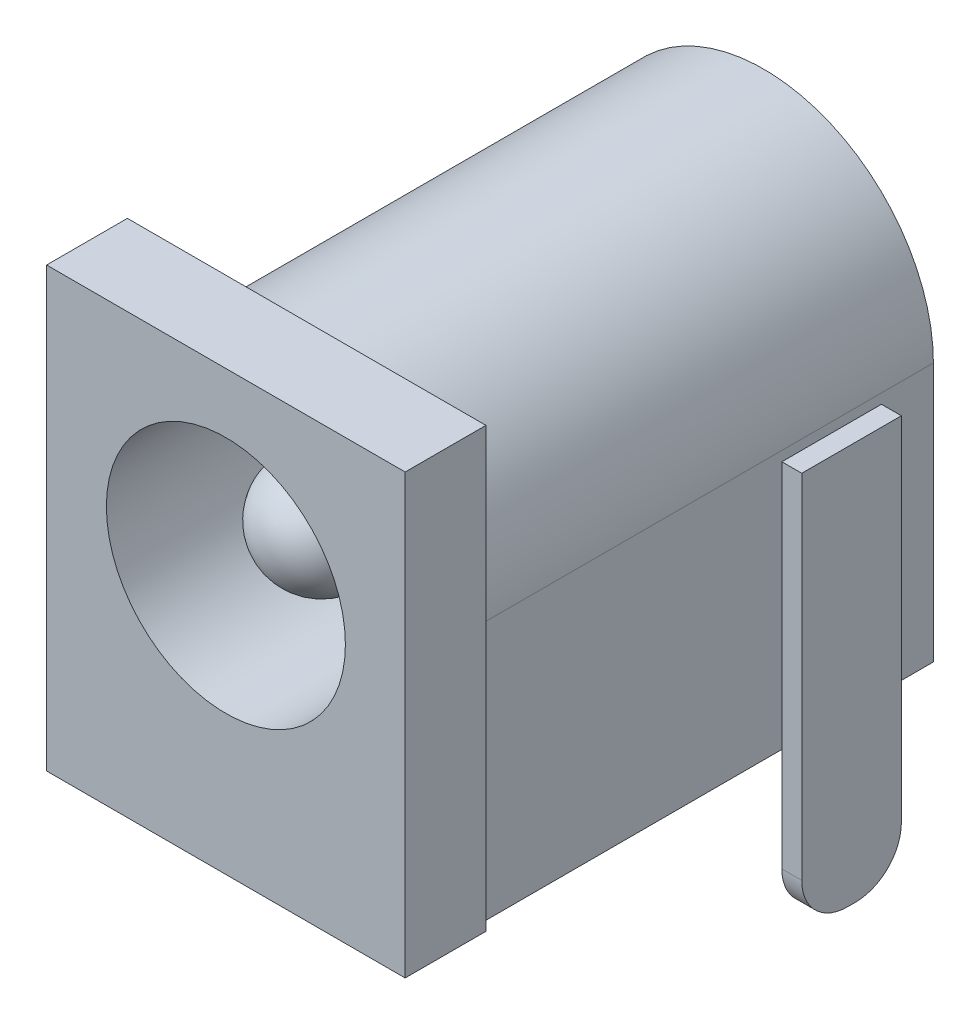
ISO-10303-21;
HEADER;
FILE_DESCRIPTION(('STEP AP214'),'2;1');
FILE_NAME('part.step','',(''),(''),'','','');
FILE_SCHEMA(('AUTOMOTIVE_DESIGN { 1 0 10303 214 1 1 1 1 }'));
ENDSEC;
DATA;
#1=APPLICATION_CONTEXT('core data for automotive mechanical design processes');
#2=APPLICATION_PROTOCOL_DEFINITION('international standard','automotive_design',2000,#1);
#3=PRODUCT_CONTEXT('',#1,'mechanical');
#4=PRODUCT('Part','Part','',(#3));
#5=PRODUCT_RELATED_PRODUCT_CATEGORY('part','',(#4));
#6=PRODUCT_DEFINITION_FORMATION('','',#4);
#7=PRODUCT_DEFINITION_CONTEXT('part definition',#1,'design');
#8=PRODUCT_DEFINITION('design','',#6,#7);
#9=PRODUCT_DEFINITION_SHAPE('','',#8);
#10=(LENGTH_UNIT() NAMED_UNIT(*) SI_UNIT(.MILLI.,.METRE.));
#11=(NAMED_UNIT(*) PLANE_ANGLE_UNIT() SI_UNIT($,.RADIAN.));
#12=(NAMED_UNIT(*) SI_UNIT($,.STERADIAN.) SOLID_ANGLE_UNIT());
#13=UNCERTAINTY_MEASURE_WITH_UNIT(LENGTH_MEASURE(1.E-05),#10,'distance_accuracy_value','');
#14=(GEOMETRIC_REPRESENTATION_CONTEXT(3) GLOBAL_UNCERTAINTY_ASSIGNED_CONTEXT((#13)) GLOBAL_UNIT_ASSIGNED_CONTEXT((#10,
#11,#12)) REPRESENTATION_CONTEXT('',''));
#15=CARTESIAN_POINT('',(0.,0.,0.));
#16=DIRECTION('',(0.,0.,1.));
#17=DIRECTION('',(1.,0.,0.));
#18=AXIS2_PLACEMENT_3D('',#15,#16,#17);
#19=CARTESIAN_POINT('',(9.50543642404111,-3.5,4.05));
#20=DIRECTION('',(-1.,0.,0.));
#21=DIRECTION('',(0.,0.,1.));
#22=AXIS2_PLACEMENT_3D('',#19,#20,#21);
#23=PLANE('',#22);
#24=CARTESIAN_POINT('',(9.50543642404111,-2.35,2.7));
#25=DIRECTION('',(1.,0.,0.));
#26=DIRECTION('',(0.,0.,-1.));
#27=AXIS2_PLACEMENT_3D('',#24,#25,#26);
#28=CIRCLE('',#27,1.15);
#29=CARTESIAN_POINT('',(9.50543642404111,-2.35,1.55));
#30=VERTEX_POINT('',#29);
#31=CARTESIAN_POINT('',(9.50543642404111,-3.5,2.7));
#32=VERTEX_POINT('',#31);
#33=EDGE_CURVE('P0_E122',#30,#32,#28,.F.);
#34=ORIENTED_EDGE('',*,*,#33,.F.);
#35=DIRECTION('',(0.,1.,0.));
#36=VECTOR('',#35,1.);
#37=CARTESIAN_POINT('',(9.50543642404111,-3.5,1.55));
#38=LINE('',#37,#36);
#39=CARTESIAN_POINT('',(9.50543642404111,6.5,1.55));
#40=VERTEX_POINT('',#39);
#41=EDGE_CURVE('P0_E86',#30,#40,#38,.T.);
#42=ORIENTED_EDGE('',*,*,#41,.T.);
#43=DIRECTION('',(0.,0.,1.));
#44=VECTOR('',#43,1.);
#45=CARTESIAN_POINT('',(9.50543642404111,6.5,1.55));
#46=LINE('',#45,#44);
#47=CARTESIAN_POINT('',(9.50543642404111,6.5,4.05));
#48=VERTEX_POINT('',#47);
#49=EDGE_CURVE('P0_E66',#48,#40,#46,.F.);
#50=ORIENTED_EDGE('',*,*,#49,.F.);
#51=DIRECTION('',(0.,1.,0.));
#52=VECTOR('',#51,1.);
#53=CARTESIAN_POINT('',(9.50543642404111,-3.5,4.05));
#54=LINE('',#53,#52);
#55=CARTESIAN_POINT('',(9.50543642404111,-2.35,4.05));
#56=VERTEX_POINT('',#55);
#57=EDGE_CURVE('P0_E142',#48,#56,#54,.F.);
#58=ORIENTED_EDGE('',*,*,#57,.T.);
#59=CARTESIAN_POINT('',(9.50543642404111,-2.35,2.9));
#60=DIRECTION('',(1.,0.,0.));
#61=DIRECTION('',(0.,0.,-1.));
#62=AXIS2_PLACEMENT_3D('',#59,#60,#61);
#63=CIRCLE('',#62,1.15);
#64=CARTESIAN_POINT('',(9.50543642404111,-3.5,2.9));
#65=VERTEX_POINT('',#64);
#66=EDGE_CURVE('P0_E19',#65,#56,#63,.F.);
#67=ORIENTED_EDGE('',*,*,#66,.F.);
#68=DIRECTION('',(0.,0.,1.));
#69=VECTOR('',#68,1.);
#70=CARTESIAN_POINT('',(9.50543642404111,-3.5,1.55));
#71=LINE('',#70,#69);
#72=EDGE_CURVE('P0_E123',#65,#32,#71,.F.);
#73=ORIENTED_EDGE('',*,*,#72,.T.);
#74=EDGE_LOOP('',(#34,#42,#50,#58,#67,#73));
#75=FACE_BOUND('',#74,.T.);
#76=ADVANCED_FACE('P0_F16',(#75),#23,.F.);
#77=CARTESIAN_POINT('',(9.00543642404111,6.5,1.55));
#78=DIRECTION('',(0.,1.,0.));
#79=DIRECTION('',(0.,0.,1.));
#80=AXIS2_PLACEMENT_3D('',#77,#78,#79);
#81=PLANE('',#80);
#82=ORIENTED_EDGE('',*,*,#49,.T.);
#83=DIRECTION('',(1.,0.,0.));
#84=VECTOR('',#83,1.);
#85=CARTESIAN_POINT('',(9.50543642404111,6.5,1.55));
#86=LINE('',#85,#84);
#87=CARTESIAN_POINT('',(9.00543642404111,6.5,1.55));
#88=VERTEX_POINT('',#87);
#89=EDGE_CURVE('P0_E89',#40,#88,#86,.F.);
#90=ORIENTED_EDGE('',*,*,#89,.T.);
#91=DIRECTION('',(0.,0.,-1.));
#92=VECTOR('',#91,1.);
#93=CARTESIAN_POINT('',(9.00543642404111,6.5,4.05));
#94=LINE('',#93,#92);
#95=CARTESIAN_POINT('',(9.00543642404111,6.5,4.05));
#96=VERTEX_POINT('',#95);
#97=EDGE_CURVE('P0_E76',#88,#96,#94,.F.);
#98=ORIENTED_EDGE('',*,*,#97,.T.);
#99=DIRECTION('',(-1.,0.,0.));
#100=VECTOR('',#99,1.);
#101=CARTESIAN_POINT('',(9.50543642404111,6.5,4.05));
#102=LINE('',#101,#100);
#103=EDGE_CURVE('P0_E140',#96,#48,#102,.F.);
#104=ORIENTED_EDGE('',*,*,#103,.T.);
#105=EDGE_LOOP('',(#82,#90,#98,#104));
#106=FACE_BOUND('',#105,.T.);
#107=ADVANCED_FACE('P0_F90',(#106),#81,.T.);
#108=CARTESIAN_POINT('',(9.50543642404111,-3.5,4.05));
#109=DIRECTION('',(0.,0.,-1.));
#110=DIRECTION('',(-1.,0.,0.));
#111=AXIS2_PLACEMENT_3D('',#108,#109,#110);
#112=PLANE('',#111);
#113=ORIENTED_EDGE('',*,*,#57,.F.);
#114=ORIENTED_EDGE('',*,*,#103,.F.);
#115=DIRECTION('',(0.,1.,0.));
#116=VECTOR('',#115,1.);
#117=CARTESIAN_POINT('',(9.00543642404111,-3.5,4.05));
#118=LINE('',#117,#116);
#119=CARTESIAN_POINT('',(9.00543642404111,-2.35,4.05));
#120=VERTEX_POINT('',#119);
#121=EDGE_CURVE('P0_E83',#96,#120,#118,.F.);
#122=ORIENTED_EDGE('',*,*,#121,.T.);
#123=DIRECTION('',(1.,0.,0.));
#124=VECTOR('',#123,1.);
#125=CARTESIAN_POINT('',(-0.00100000000000737,-2.35,4.05));
#126=LINE('',#125,#124);
#127=EDGE_CURVE('P0_E138',#56,#120,#126,.F.);
#128=ORIENTED_EDGE('',*,*,#127,.F.);
#129=EDGE_LOOP('',(#113,#114,#122,#128));
#130=FACE_BOUND('',#129,.T.);
#131=ADVANCED_FACE('P0_F113',(#130),#112,.F.);
#132=CARTESIAN_POINT('',(-0.00100000000000794,-2.35,2.9));
#133=DIRECTION('',(1.,0.,0.));
#134=DIRECTION('',(0.,0.,-1.));
#135=AXIS2_PLACEMENT_3D('',#132,#133,#134);
#136=CYLINDRICAL_SURFACE('',#135,1.15);
#137=ORIENTED_EDGE('',*,*,#66,.T.);
#138=ORIENTED_EDGE('',*,*,#127,.T.);
#139=CARTESIAN_POINT('',(9.00543642404111,-2.35,2.9));
#140=DIRECTION('',(1.,0.,0.));
#141=DIRECTION('',(0.,0.,-1.));
#142=AXIS2_PLACEMENT_3D('',#139,#140,#141);
#143=CIRCLE('',#142,1.15);
#144=CARTESIAN_POINT('',(9.00543642404111,-3.5,2.9));
#145=VERTEX_POINT('',#144);
#146=EDGE_CURVE('P0_E156',#120,#145,#143,.T.);
#147=ORIENTED_EDGE('',*,*,#146,.T.);
#148=DIRECTION('',(1.,0.,0.));
#149=VECTOR('',#148,1.);
#150=CARTESIAN_POINT('',(9.00543642404111,-3.5,2.9));
#151=LINE('',#150,#149);
#152=EDGE_CURVE('P0_E136',#145,#65,#151,.T.);
#153=ORIENTED_EDGE('',*,*,#152,.T.);
#154=EDGE_LOOP('',(#137,#138,#147,#153));
#155=FACE_BOUND('',#154,.T.);
#156=ADVANCED_FACE('P0_F109',(#155),#136,.T.);
#157=CARTESIAN_POINT('',(9.00543642404111,-3.5,1.55));
#158=DIRECTION('',(0.,1.,0.));
#159=DIRECTION('',(0.,0.,1.));
#160=AXIS2_PLACEMENT_3D('',#157,#158,#159);
#161=PLANE('',#160);
#162=ORIENTED_EDGE('',*,*,#72,.F.);
#163=ORIENTED_EDGE('',*,*,#152,.F.);
#164=DIRECTION('',(0.,0.,-1.));
#165=VECTOR('',#164,1.);
#166=CARTESIAN_POINT('',(9.00543642404111,-3.5,4.05));
#167=LINE('',#166,#165);
#168=CARTESIAN_POINT('',(9.00543642404111,-3.5,2.7));
#169=VERTEX_POINT('',#168);
#170=EDGE_CURVE('P0_E155',#145,#169,#167,.T.);
#171=ORIENTED_EDGE('',*,*,#170,.T.);
#172=DIRECTION('',(1.,0.,0.));
#173=VECTOR('',#172,1.);
#174=CARTESIAN_POINT('',(-0.00100000000000794,-3.5,2.7));
#175=LINE('',#174,#173);
#176=EDGE_CURVE('P0_E91',#32,#169,#175,.F.);
#177=ORIENTED_EDGE('',*,*,#176,.F.);
#178=EDGE_LOOP('',(#162,#163,#171,#177));
#179=FACE_BOUND('',#178,.T.);
#180=ADVANCED_FACE('P0_F103',(#179),#161,.F.);
#181=CARTESIAN_POINT('',(-0.00100000000000794,-2.35,2.7));
#182=DIRECTION('',(1.,0.,0.));
#183=DIRECTION('',(0.,0.,-1.));
#184=AXIS2_PLACEMENT_3D('',#181,#182,#183);
#185=CYLINDRICAL_SURFACE('',#184,1.15);
#186=ORIENTED_EDGE('',*,*,#33,.T.);
#187=ORIENTED_EDGE('',*,*,#176,.T.);
#188=CARTESIAN_POINT('',(9.00543642404111,-2.35,2.7));
#189=DIRECTION('',(1.,0.,0.));
#190=DIRECTION('',(0.,0.,-1.));
#191=AXIS2_PLACEMENT_3D('',#188,#189,#190);
#192=CIRCLE('',#191,1.15);
#193=CARTESIAN_POINT('',(9.00543642404111,-2.35,1.55));
#194=VERTEX_POINT('',#193);
#195=EDGE_CURVE('P0_E25',#169,#194,#192,.T.);
#196=ORIENTED_EDGE('',*,*,#195,.T.);
#197=DIRECTION('',(1.,0.,0.));
#198=VECTOR('',#197,1.);
#199=CARTESIAN_POINT('',(9.50543642404111,-2.35,1.55));
#200=LINE('',#199,#198);
#201=EDGE_CURVE('P0_E33',#194,#30,#200,.T.);
#202=ORIENTED_EDGE('',*,*,#201,.T.);
#203=EDGE_LOOP('',(#186,#187,#196,#202));
#204=FACE_BOUND('',#203,.T.);
#205=ADVANCED_FACE('P0_F95',(#204),#185,.T.);
#206=CARTESIAN_POINT('',(9.50543642404111,-3.5,1.55));
#207=DIRECTION('',(0.,0.,1.));
#208=DIRECTION('',(1.,0.,0.));
#209=AXIS2_PLACEMENT_3D('',#206,#207,#208);
#210=PLANE('',#209);
#211=ORIENTED_EDGE('',*,*,#201,.F.);
#212=DIRECTION('',(0.,1.,0.));
#213=VECTOR('',#212,1.);
#214=CARTESIAN_POINT('',(9.00543642404111,-3.5,1.55));
#215=LINE('',#214,#213);
#216=EDGE_CURVE('P0_E11',#194,#88,#215,.T.);
#217=ORIENTED_EDGE('',*,*,#216,.T.);
#218=ORIENTED_EDGE('',*,*,#89,.F.);
#219=ORIENTED_EDGE('',*,*,#41,.F.);
#220=EDGE_LOOP('',(#211,#217,#218,#219));
#221=FACE_BOUND('',#220,.T.);
#222=ADVANCED_FACE('P0_F93',(#221),#210,.F.);
#223=CARTESIAN_POINT('',(9.00543642404111,-3.5,4.05));
#224=DIRECTION('',(1.,0.,0.));
#225=DIRECTION('',(0.,0.,-1.));
#226=AXIS2_PLACEMENT_3D('',#223,#224,#225);
#227=PLANE('',#226);
#228=ORIENTED_EDGE('',*,*,#195,.F.);
#229=ORIENTED_EDGE('',*,*,#170,.F.);
#230=ORIENTED_EDGE('',*,*,#146,.F.);
#231=ORIENTED_EDGE('',*,*,#121,.F.);
#232=ORIENTED_EDGE('',*,*,#97,.F.);
#233=ORIENTED_EDGE('',*,*,#216,.F.);
#234=EDGE_LOOP('',(#228,#229,#230,#231,#232,#233));
#235=FACE_BOUND('',#234,.T.);
#236=ADVANCED_FACE('P0_F79',(#235),#227,.F.);
#237=CLOSED_SHELL('',(#76,#107,#131,#156,#180,#205,#222,#236));
#238=MANIFOLD_SOLID_BREP('P0_B1',#237);
#239=CARTESIAN_POINT('',(4.5,6.5,11.100625080339));
#240=DIRECTION('',(1.,0.,0.));
#241=DIRECTION('',(0.,0.,-1.));
#242=AXIS2_PLACEMENT_3D('',#239,#240,#241);
#243=SPHERICAL_SURFACE('',#242,1.39937491966099);
#244=CARTESIAN_POINT('',(4.5,6.5,11.5));
#245=DIRECTION('',(0.,0.,-1.));
#246=DIRECTION('',(-1.,0.,0.));
#247=AXIS2_PLACEMENT_3D('',#244,#245,#246);
#248=CIRCLE('',#247,1.3411747981982);
#249=CARTESIAN_POINT('',(3.1588252018018,6.5,11.5));
#250=VERTEX_POINT('',#249);
#251=EDGE_CURVE('P1_E20',#250,#250,#248,.T.);
#252=ORIENTED_EDGE('',*,*,#251,.F.);
#253=EDGE_LOOP('',(#252));
#254=FACE_BOUND('',#253,.T.);
#255=ADVANCED_FACE('P1_F16',(#254),#243,.T.);
#256=CARTESIAN_POINT('',(4.5,6.5,11.5));
#257=DIRECTION('',(0.,0.,-1.));
#258=DIRECTION('',(-1.,0.,0.));
#259=AXIS2_PLACEMENT_3D('',#256,#257,#258);
#260=CYLINDRICAL_SURFACE('',#259,1.3411747981982);
#261=CARTESIAN_POINT('',(4.5,6.5,3.));
#262=DIRECTION('',(0.,0.,-1.));
#263=DIRECTION('',(-1.,0.,0.));
#264=AXIS2_PLACEMENT_3D('',#261,#262,#263);
#265=CIRCLE('',#264,1.3411747981982);
#266=CARTESIAN_POINT('',(3.1588252018018,6.5,3.));
#267=VERTEX_POINT('',#266);
#268=EDGE_CURVE('P1_E142',#267,#267,#265,.T.);
#269=ORIENTED_EDGE('',*,*,#268,.F.);
#270=EDGE_LOOP('',(#269));
#271=FACE_BOUND('',#270,.T.);
#272=ORIENTED_EDGE('',*,*,#251,.T.);
#273=EDGE_LOOP('',(#272));
#274=FACE_BOUND('',#273,.T.);
#275=ADVANCED_FACE('P1_F227',(#271,#274),#260,.T.);
#276=CARTESIAN_POINT('',(4.5,6.5,3.));
#277=DIRECTION('',(0.,0.,1.));
#278=DIRECTION('',(1.,0.,0.));
#279=AXIS2_PLACEMENT_3D('',#276,#277,#278);
#280=PLANE('',#279);
#281=ORIENTED_EDGE('',*,*,#268,.T.);
#282=EDGE_LOOP('',(#281));
#283=FACE_BOUND('',#282,.T.);
#284=CARTESIAN_POINT('',(4.5,6.5,3.));
#285=DIRECTION('',(0.,0.,1.));
#286=DIRECTION('',(1.,0.,0.));
#287=AXIS2_PLACEMENT_3D('',#284,#285,#286);
#288=CIRCLE('',#287,3.);
#289=CARTESIAN_POINT('',(7.5,6.5,3.));
#290=VERTEX_POINT('',#289);
#291=EDGE_CURVE('P1_E218',#290,#290,#288,.T.);
#292=ORIENTED_EDGE('',*,*,#291,.T.);
#293=EDGE_LOOP('',(#292));
#294=FACE_BOUND('',#293,.T.);
#295=ADVANCED_FACE('P1_F234',(#283,#294),#280,.T.);
#296=CARTESIAN_POINT('',(3.25,-3.5,6.05));
#297=DIRECTION('',(1.,0.,0.));
#298=DIRECTION('',(0.,0.,-1.));
#299=AXIS2_PLACEMENT_3D('',#296,#297,#298);
#300=PLANE('',#299);
#301=DIRECTION('',(0.,1.,0.));
#302=VECTOR('',#301,1.);
#303=CARTESIAN_POINT('',(3.25,-3.5,5.55));
#304=LINE('',#303,#302);
#305=CARTESIAN_POINT('',(3.25,0.,5.55));
#306=VERTEX_POINT('',#305);
#307=CARTESIAN_POINT('',(3.25,-2.35,5.55));
#308=VERTEX_POINT('',#307);
#309=EDGE_CURVE('P1_E133',#306,#308,#304,.F.);
#310=ORIENTED_EDGE('',*,*,#309,.T.);
#311=DIRECTION('',(0.,0.,-1.));
#312=VECTOR('',#311,1.);
#313=CARTESIAN_POINT('',(3.25,-2.35,11.9209561867341));
#314=LINE('',#313,#312);
#315=CARTESIAN_POINT('',(3.25,-2.35,6.05));
#316=VERTEX_POINT('',#315);
#317=EDGE_CURVE('P1_E141',#316,#308,#314,.T.);
#318=ORIENTED_EDGE('',*,*,#317,.F.);
#319=DIRECTION('',(0.,1.,0.));
#320=VECTOR('',#319,1.);
#321=CARTESIAN_POINT('',(3.25,-3.5,6.05));
#322=LINE('',#321,#320);
#323=CARTESIAN_POINT('',(3.25,0.,6.05));
#324=VERTEX_POINT('',#323);
#325=EDGE_CURVE('P1_E136',#316,#324,#322,.T.);
#326=ORIENTED_EDGE('',*,*,#325,.T.);
#327=DIRECTION('',(0.,0.,-1.));
#328=VECTOR('',#327,1.);
#329=CARTESIAN_POINT('',(3.25,0.,6.05));
#330=LINE('',#329,#328);
#331=EDGE_CURVE('P1_E130',#306,#324,#330,.F.);
#332=ORIENTED_EDGE('',*,*,#331,.F.);
#333=EDGE_LOOP('',(#310,#318,#326,#332));
#334=FACE_BOUND('',#333,.T.);
#335=ADVANCED_FACE('P1_F132',(#334),#300,.F.);
#336=CARTESIAN_POINT('',(4.4,-2.35,11.9209561867341));
#337=DIRECTION('',(0.,0.,-1.));
#338=DIRECTION('',(-1.,0.,0.));
#339=AXIS2_PLACEMENT_3D('',#336,#337,#338);
#340=CYLINDRICAL_SURFACE('',#339,1.15);
#341=ORIENTED_EDGE('',*,*,#317,.T.);
#342=CARTESIAN_POINT('',(4.4,-2.35,5.55));
#343=DIRECTION('',(0.,0.,-1.));
#344=DIRECTION('',(-1.,0.,0.));
#345=AXIS2_PLACEMENT_3D('',#342,#343,#344);
#346=CIRCLE('',#345,1.15);
#347=CARTESIAN_POINT('',(4.4,-3.5,5.55));
#348=VERTEX_POINT('',#347);
#349=EDGE_CURVE('P1_E152',#308,#348,#346,.F.);
#350=ORIENTED_EDGE('',*,*,#349,.T.);
#351=DIRECTION('',(0.,0.,1.));
#352=VECTOR('',#351,1.);
#353=CARTESIAN_POINT('',(4.4,-3.5,5.55));
#354=LINE('',#353,#352);
#355=CARTESIAN_POINT('',(4.4,-3.5,6.05));
#356=VERTEX_POINT('',#355);
#357=EDGE_CURVE('P1_E176',#348,#356,#354,.T.);
#358=ORIENTED_EDGE('',*,*,#357,.T.);
#359=CARTESIAN_POINT('',(4.4,-2.35,6.05));
#360=DIRECTION('',(0.,0.,-1.));
#361=DIRECTION('',(-1.,0.,0.));
#362=AXIS2_PLACEMENT_3D('',#359,#360,#361);
#363=CIRCLE('',#362,1.15);
#364=EDGE_CURVE('P1_E209',#356,#316,#363,.T.);
#365=ORIENTED_EDGE('',*,*,#364,.T.);
#366=EDGE_LOOP('',(#341,#350,#358,#365));
#367=FACE_BOUND('',#366,.T.);
#368=ADVANCED_FACE('P1_F328',(#367),#340,.T.);
#369=CARTESIAN_POINT('',(5.75,-3.5,5.55));
#370=DIRECTION('',(0.,1.,0.));
#371=DIRECTION('',(0.,0.,1.));
#372=AXIS2_PLACEMENT_3D('',#369,#370,#371);
#373=PLANE('',#372);
#374=DIRECTION('',(0.,0.,-1.));
#375=VECTOR('',#374,1.);
#376=CARTESIAN_POINT('',(4.6,-3.5,11.9209561867341));
#377=LINE('',#376,#375);
#378=CARTESIAN_POINT('',(4.6,-3.5,6.05));
#379=VERTEX_POINT('',#378);
#380=CARTESIAN_POINT('',(4.6,-3.5,5.55));
#381=VERTEX_POINT('',#380);
#382=EDGE_CURVE('P1_E172',#379,#381,#377,.T.);
#383=ORIENTED_EDGE('',*,*,#382,.F.);
#384=DIRECTION('',(-1.,0.,0.));
#385=VECTOR('',#384,1.);
#386=CARTESIAN_POINT('',(5.75,-3.5,6.05));
#387=LINE('',#386,#385);
#388=EDGE_CURVE('P1_E153',#379,#356,#387,.T.);
#389=ORIENTED_EDGE('',*,*,#388,.T.);
#390=ORIENTED_EDGE('',*,*,#357,.F.);
#391=DIRECTION('',(1.,0.,0.));
#392=VECTOR('',#391,1.);
#393=CARTESIAN_POINT('',(5.75,-3.5,5.55));
#394=LINE('',#393,#392);
#395=EDGE_CURVE('P1_E203',#348,#381,#394,.T.);
#396=ORIENTED_EDGE('',*,*,#395,.T.);
#397=EDGE_LOOP('',(#383,#389,#390,#396));
#398=FACE_BOUND('',#397,.T.);
#399=ADVANCED_FACE('P1_F324',(#398),#373,.F.);
#400=CARTESIAN_POINT('',(4.6,-2.35,11.9209561867341));
#401=DIRECTION('',(0.,0.,-1.));
#402=DIRECTION('',(-1.,0.,0.));
#403=AXIS2_PLACEMENT_3D('',#400,#401,#402);
#404=CYLINDRICAL_SURFACE('',#403,1.15);
#405=ORIENTED_EDGE('',*,*,#382,.T.);
#406=CARTESIAN_POINT('',(4.6,-2.35,5.55));
#407=DIRECTION('',(0.,0.,-1.));
#408=DIRECTION('',(-1.,0.,0.));
#409=AXIS2_PLACEMENT_3D('',#406,#407,#408);
#410=CIRCLE('',#409,1.15);
#411=CARTESIAN_POINT('',(5.75,-2.35,5.55));
#412=VERTEX_POINT('',#411);
#413=EDGE_CURVE('P1_E201',#381,#412,#410,.F.);
#414=ORIENTED_EDGE('',*,*,#413,.T.);
#415=DIRECTION('',(0.,0.,1.));
#416=VECTOR('',#415,1.);
#417=CARTESIAN_POINT('',(5.75,-2.35,6.05));
#418=LINE('',#417,#416);
#419=CARTESIAN_POINT('',(5.75,-2.35,6.05));
#420=VERTEX_POINT('',#419);
#421=EDGE_CURVE('P1_E175',#412,#420,#418,.T.);
#422=ORIENTED_EDGE('',*,*,#421,.T.);
#423=CARTESIAN_POINT('',(4.6,-2.35,6.05));
#424=DIRECTION('',(0.,0.,-1.));
#425=DIRECTION('',(-1.,0.,0.));
#426=AXIS2_PLACEMENT_3D('',#423,#424,#425);
#427=CIRCLE('',#426,1.15);
#428=EDGE_CURVE('P1_E205',#420,#379,#427,.T.);
#429=ORIENTED_EDGE('',*,*,#428,.T.);
#430=EDGE_LOOP('',(#405,#414,#422,#429));
#431=FACE_BOUND('',#430,.T.);
#432=ADVANCED_FACE('P1_F320',(#431),#404,.T.);
#433=CARTESIAN_POINT('',(5.75,-3.5,6.05));
#434=DIRECTION('',(-1.,0.,0.));
#435=DIRECTION('',(0.,0.,1.));
#436=AXIS2_PLACEMENT_3D('',#433,#434,#435);
#437=PLANE('',#436);
#438=DIRECTION('',(0.,1.,0.));
#439=VECTOR('',#438,1.);
#440=CARTESIAN_POINT('',(5.75,-3.5,6.05));
#441=LINE('',#440,#439);
#442=CARTESIAN_POINT('',(5.75,0.,6.05));
#443=VERTEX_POINT('',#442);
#444=EDGE_CURVE('P1_E208',#443,#420,#441,.F.);
#445=ORIENTED_EDGE('',*,*,#444,.T.);
#446=ORIENTED_EDGE('',*,*,#421,.F.);
#447=DIRECTION('',(0.,1.,0.));
#448=VECTOR('',#447,1.);
#449=CARTESIAN_POINT('',(5.75,-3.5,5.55));
#450=LINE('',#449,#448);
#451=CARTESIAN_POINT('',(5.75,0.,5.55));
#452=VERTEX_POINT('',#451);
#453=EDGE_CURVE('P1_E200',#412,#452,#450,.T.);
#454=ORIENTED_EDGE('',*,*,#453,.T.);
#455=DIRECTION('',(0.,0.,1.));
#456=VECTOR('',#455,1.);
#457=CARTESIAN_POINT('',(5.75,0.,6.05));
#458=LINE('',#457,#456);
#459=EDGE_CURVE('P1_E156',#443,#452,#458,.F.);
#460=ORIENTED_EDGE('',*,*,#459,.F.);
#461=EDGE_LOOP('',(#445,#446,#454,#460));
#462=FACE_BOUND('',#461,.T.);
#463=ADVANCED_FACE('P1_F317',(#462),#437,.F.);
#464=CARTESIAN_POINT('',(4.4,-2.35,11.9209561867341));
#465=DIRECTION('',(0.,0.,-1.));
#466=DIRECTION('',(-1.,0.,0.));
#467=AXIS2_PLACEMENT_3D('',#464,#465,#466);
#468=CYLINDRICAL_SURFACE('',#467,1.15);
#469=DIRECTION('',(0.,0.,-1.));
#470=VECTOR('',#469,1.);
#471=CARTESIAN_POINT('',(4.4,-3.5,0.173550286922379));
#472=LINE('',#471,#470);
#473=CARTESIAN_POINT('',(4.4,-3.5,0.173550286922378));
#474=VERTEX_POINT('',#473);
#475=CARTESIAN_POINT('',(4.4,-3.5,-0.326449713077622));
#476=VERTEX_POINT('',#475);
#477=EDGE_CURVE('P1_E220',#474,#476,#472,.T.);
#478=ORIENTED_EDGE('',*,*,#477,.F.);
#479=CARTESIAN_POINT('',(4.4,-2.35,0.173550286922378));
#480=DIRECTION('',(0.,0.,-1.));
#481=DIRECTION('',(-1.,0.,0.));
#482=AXIS2_PLACEMENT_3D('',#479,#480,#481);
#483=CIRCLE('',#482,1.15);
#484=CARTESIAN_POINT('',(3.25,-2.35,0.173550286922378));
#485=VERTEX_POINT('',#484);
#486=EDGE_CURVE('P1_E198',#474,#485,#483,.T.);
#487=ORIENTED_EDGE('',*,*,#486,.T.);
#488=DIRECTION('',(0.,0.,-1.));
#489=VECTOR('',#488,1.);
#490=CARTESIAN_POINT('',(3.25,-2.35,11.9209561867341));
#491=LINE('',#490,#489);
#492=CARTESIAN_POINT('',(3.25,-2.35,-0.326449713077622));
#493=VERTEX_POINT('',#492);
#494=EDGE_CURVE('P1_E96',#485,#493,#491,.T.);
#495=ORIENTED_EDGE('',*,*,#494,.T.);
#496=CARTESIAN_POINT('',(4.4,-2.35,-0.326449713077622));
#497=DIRECTION('',(0.,0.,-1.));
#498=DIRECTION('',(-1.,0.,0.));
#499=AXIS2_PLACEMENT_3D('',#496,#497,#498);
#500=CIRCLE('',#499,1.15);
#501=EDGE_CURVE('P1_E216',#493,#476,#500,.F.);
#502=ORIENTED_EDGE('',*,*,#501,.T.);
#503=EDGE_LOOP('',(#478,#487,#495,#502));
#504=FACE_BOUND('',#503,.T.);
#505=ADVANCED_FACE('P1_F313',(#504),#468,.T.);
#506=CARTESIAN_POINT('',(4.6,-2.35,11.9209561867341));
#507=DIRECTION('',(0.,0.,-1.));
#508=DIRECTION('',(-1.,0.,0.));
#509=AXIS2_PLACEMENT_3D('',#506,#507,#508);
#510=CYLINDRICAL_SURFACE('',#509,1.15);
#511=DIRECTION('',(0.,0.,-1.));
#512=VECTOR('',#511,1.);
#513=CARTESIAN_POINT('',(5.75,-2.35,11.9209561867341));
#514=LINE('',#513,#512);
#515=CARTESIAN_POINT('',(5.75,-2.35,-0.326449713077622));
#516=VERTEX_POINT('',#515);
#517=CARTESIAN_POINT('',(5.75,-2.35,0.173550286922378));
#518=VERTEX_POINT('',#517);
#519=EDGE_CURVE('P1_E644',#516,#518,#514,.F.);
#520=ORIENTED_EDGE('',*,*,#519,.T.);
#521=CARTESIAN_POINT('',(4.6,-2.35,0.173550286922378));
#522=DIRECTION('',(0.,0.,-1.));
#523=DIRECTION('',(-1.,0.,0.));
#524=AXIS2_PLACEMENT_3D('',#521,#522,#523);
#525=CIRCLE('',#524,1.15);
#526=CARTESIAN_POINT('',(4.6,-3.5,0.173550286922378));
#527=VERTEX_POINT('',#526);
#528=EDGE_CURVE('P1_E196',#518,#527,#525,.T.);
#529=ORIENTED_EDGE('',*,*,#528,.T.);
#530=DIRECTION('',(0.,0.,-1.));
#531=VECTOR('',#530,1.);
#532=CARTESIAN_POINT('',(4.6,-3.5,0.173550286922379));
#533=LINE('',#532,#531);
#534=CARTESIAN_POINT('',(4.6,-3.5,-0.326449713077622));
#535=VERTEX_POINT('',#534);
#536=EDGE_CURVE('P1_E641',#535,#527,#533,.F.);
#537=ORIENTED_EDGE('',*,*,#536,.F.);
#538=CARTESIAN_POINT('',(4.6,-2.35,-0.326449713077622));
#539=DIRECTION('',(0.,0.,-1.));
#540=DIRECTION('',(-1.,0.,0.));
#541=AXIS2_PLACEMENT_3D('',#538,#539,#540);
#542=CIRCLE('',#541,1.15);
#543=EDGE_CURVE('P1_E212',#535,#516,#542,.F.);
#544=ORIENTED_EDGE('',*,*,#543,.T.);
#545=EDGE_LOOP('',(#520,#529,#537,#544));
#546=FACE_BOUND('',#545,.T.);
#547=ADVANCED_FACE('P1_F309',(#546),#510,.T.);
#548=CARTESIAN_POINT('',(5.75,-3.5,0.173550286922379));
#549=DIRECTION('',(0.,-1.,0.));
#550=DIRECTION('',(0.,0.,-1.));
#551=AXIS2_PLACEMENT_3D('',#548,#549,#550);
#552=PLANE('',#551);
#553=DIRECTION('',(-1.,0.,0.));
#554=VECTOR('',#553,1.);
#555=CARTESIAN_POINT('',(5.75,-3.5,0.173550286922379));
#556=LINE('',#555,#554);
#557=EDGE_CURVE('P1_E195',#527,#474,#556,.T.);
#558=ORIENTED_EDGE('',*,*,#557,.T.);
#559=ORIENTED_EDGE('',*,*,#477,.T.);
#560=DIRECTION('',(1.,0.,0.));
#561=VECTOR('',#560,1.);
#562=CARTESIAN_POINT('',(5.75,-3.5,-0.326449713077622));
#563=LINE('',#562,#561);
#564=EDGE_CURVE('P1_E215',#476,#535,#563,.T.);
#565=ORIENTED_EDGE('',*,*,#564,.T.);
#566=ORIENTED_EDGE('',*,*,#536,.T.);
#567=EDGE_LOOP('',(#558,#559,#565,#566));
#568=FACE_BOUND('',#567,.T.);
#569=ADVANCED_FACE('P1_F305',(#568),#552,.T.);
#570=CARTESIAN_POINT('',(4.5,6.5,3.));
#571=DIRECTION('',(0.,0.,1.));
#572=DIRECTION('',(1.,0.,0.));
#573=AXIS2_PLACEMENT_3D('',#570,#571,#572);
#574=CYLINDRICAL_SURFACE('',#573,3.);
#575=ORIENTED_EDGE('',*,*,#291,.F.);
#576=EDGE_LOOP('',(#575));
#577=FACE_BOUND('',#576,.T.);
#578=CARTESIAN_POINT('',(4.5,6.5,13.5));
#579=DIRECTION('',(0.,0.,1.));
#580=DIRECTION('',(1.,0.,0.));
#581=AXIS2_PLACEMENT_3D('',#578,#579,#580);
#582=CIRCLE('',#581,3.);
#583=CARTESIAN_POINT('',(7.5,6.5,13.5));
#584=VERTEX_POINT('',#583);
#585=EDGE_CURVE('P1_E191',#584,#584,#582,.T.);
#586=ORIENTED_EDGE('',*,*,#585,.T.);
#587=EDGE_LOOP('',(#586));
#588=FACE_BOUND('',#587,.T.);
#589=ADVANCED_FACE('P1_F302',(#577,#588),#574,.F.);
#590=CARTESIAN_POINT('',(5.75,-3.5,-0.326449713077622));
#591=DIRECTION('',(0.,0.,1.));
#592=DIRECTION('',(1.,0.,0.));
#593=AXIS2_PLACEMENT_3D('',#590,#591,#592);
#594=PLANE('',#593);
#595=ORIENTED_EDGE('',*,*,#543,.F.);
#596=ORIENTED_EDGE('',*,*,#564,.F.);
#597=ORIENTED_EDGE('',*,*,#501,.F.);
#598=DIRECTION('',(0.,1.,0.));
#599=VECTOR('',#598,1.);
#600=CARTESIAN_POINT('',(3.25,-3.5,-0.326449713077622));
#601=LINE('',#600,#599);
#602=CARTESIAN_POINT('',(3.25,6.5,-0.326449713077622));
#603=VERTEX_POINT('',#602);
#604=EDGE_CURVE('P1_E104',#493,#603,#601,.T.);
#605=ORIENTED_EDGE('',*,*,#604,.T.);
#606=DIRECTION('',(1.,0.,0.));
#607=VECTOR('',#606,1.);
#608=CARTESIAN_POINT('',(5.75,6.5,-0.326449713077622));
#609=LINE('',#608,#607);
#610=CARTESIAN_POINT('',(5.75,6.5,-0.326449713077622));
#611=VERTEX_POINT('',#610);
#612=EDGE_CURVE('P1_E624',#603,#611,#609,.T.);
#613=ORIENTED_EDGE('',*,*,#612,.T.);
#614=DIRECTION('',(0.,1.,0.));
#615=VECTOR('',#614,1.);
#616=CARTESIAN_POINT('',(5.75,-3.5,-0.326449713077622));
#617=LINE('',#616,#615);
#618=EDGE_CURVE('P1_E194',#611,#516,#617,.F.);
#619=ORIENTED_EDGE('',*,*,#618,.T.);
#620=EDGE_LOOP('',(#595,#596,#597,#605,#613,#619));
#621=FACE_BOUND('',#620,.T.);
#622=ADVANCED_FACE('P1_F298',(#621),#594,.F.);
#623=CARTESIAN_POINT('',(5.75,-3.5,6.05));
#624=DIRECTION('',(0.,0.,-1.));
#625=DIRECTION('',(-1.,0.,0.));
#626=AXIS2_PLACEMENT_3D('',#623,#624,#625);
#627=PLANE('',#626);
#628=ORIENTED_EDGE('',*,*,#428,.F.);
#629=ORIENTED_EDGE('',*,*,#444,.F.);
#630=DIRECTION('',(1.,0.,0.));
#631=VECTOR('',#630,1.);
#632=CARTESIAN_POINT('',(0.,0.,6.05));
#633=LINE('',#632,#631);
#634=EDGE_CURVE('P1_E159',#443,#324,#633,.F.);
#635=ORIENTED_EDGE('',*,*,#634,.T.);
#636=ORIENTED_EDGE('',*,*,#325,.F.);
#637=ORIENTED_EDGE('',*,*,#364,.F.);
#638=ORIENTED_EDGE('',*,*,#388,.F.);
#639=EDGE_LOOP('',(#628,#629,#635,#636,#637,#638));
#640=FACE_BOUND('',#639,.T.);
#641=ADVANCED_FACE('P1_F295',(#640),#627,.F.);
#642=CARTESIAN_POINT('',(5.75,-3.5,5.55));
#643=DIRECTION('',(0.,0.,1.));
#644=DIRECTION('',(1.,0.,0.));
#645=AXIS2_PLACEMENT_3D('',#642,#643,#644);
#646=PLANE('',#645);
#647=ORIENTED_EDGE('',*,*,#413,.F.);
#648=ORIENTED_EDGE('',*,*,#395,.F.);
#649=ORIENTED_EDGE('',*,*,#349,.F.);
#650=ORIENTED_EDGE('',*,*,#309,.F.);
#651=DIRECTION('',(1.,0.,0.));
#652=VECTOR('',#651,1.);
#653=CARTESIAN_POINT('',(0.,0.,5.55));
#654=LINE('',#653,#652);
#655=EDGE_CURVE('P1_E150',#306,#452,#654,.T.);
#656=ORIENTED_EDGE('',*,*,#655,.T.);
#657=ORIENTED_EDGE('',*,*,#453,.F.);
#658=EDGE_LOOP('',(#647,#648,#649,#650,#656,#657));
#659=FACE_BOUND('',#658,.T.);
#660=ADVANCED_FACE('P1_F148',(#659),#646,.F.);
#661=CARTESIAN_POINT('',(5.75,-3.5,0.173550286922379));
#662=DIRECTION('',(0.,0.,-1.));
#663=DIRECTION('',(-1.,0.,0.));
#664=AXIS2_PLACEMENT_3D('',#661,#662,#663);
#665=PLANE('',#664);
#666=ORIENTED_EDGE('',*,*,#528,.F.);
#667=DIRECTION('',(0.,1.,0.));
#668=VECTOR('',#667,1.);
#669=CARTESIAN_POINT('',(5.75,-3.5,0.173550286922378));
#670=LINE('',#669,#668);
#671=CARTESIAN_POINT('',(5.75,0.,0.173550286922378));
#672=VERTEX_POINT('',#671);
#673=EDGE_CURVE('P1_E627',#518,#672,#670,.T.);
#674=ORIENTED_EDGE('',*,*,#673,.T.);
#675=DIRECTION('',(1.,0.,0.));
#676=VECTOR('',#675,1.);
#677=CARTESIAN_POINT('',(0.,0.,0.173550286922378));
#678=LINE('',#677,#676);
#679=CARTESIAN_POINT('',(3.25,0.,0.173550286922378));
#680=VERTEX_POINT('',#679);
#681=EDGE_CURVE('P1_E158',#672,#680,#678,.F.);
#682=ORIENTED_EDGE('',*,*,#681,.T.);
#683=DIRECTION('',(0.,1.,0.));
#684=VECTOR('',#683,1.);
#685=CARTESIAN_POINT('',(3.25,-3.5,0.173550286922379));
#686=LINE('',#685,#684);
#687=EDGE_CURVE('P1_E632',#680,#485,#686,.F.);
#688=ORIENTED_EDGE('',*,*,#687,.T.);
#689=ORIENTED_EDGE('',*,*,#486,.F.);
#690=ORIENTED_EDGE('',*,*,#557,.F.);
#691=EDGE_LOOP('',(#666,#674,#682,#688,#689,#690));
#692=FACE_BOUND('',#691,.T.);
#693=ADVANCED_FACE('P1_F288',(#692),#665,.F.);
#694=CARTESIAN_POINT('',(0.,11.,13.5));
#695=DIRECTION('',(0.,0.,-1.));
#696=DIRECTION('',(-1.,0.,0.));
#697=AXIS2_PLACEMENT_3D('',#694,#695,#696);
#698=PLANE('',#697);
#699=DIRECTION('',(1.,0.,0.));
#700=VECTOR('',#699,1.);
#701=CARTESIAN_POINT('',(0.,0.,13.5));
#702=LINE('',#701,#700);
#703=CARTESIAN_POINT('',(0.,0.,13.5));
#704=VERTEX_POINT('',#703);
#705=CARTESIAN_POINT('',(9.,0.,13.5));
#706=VERTEX_POINT('',#705);
#707=EDGE_CURVE('P1_E670',#704,#706,#702,.T.);
#708=ORIENTED_EDGE('',*,*,#707,.T.);
#709=DIRECTION('',(0.,-1.,0.));
#710=VECTOR('',#709,1.);
#711=CARTESIAN_POINT('',(9.,0.,13.5));
#712=LINE('',#711,#710);
#713=CARTESIAN_POINT('',(9.,11.,13.5));
#714=VERTEX_POINT('',#713);
#715=EDGE_CURVE('P1_E677',#706,#714,#712,.F.);
#716=ORIENTED_EDGE('',*,*,#715,.T.);
#717=DIRECTION('',(1.,0.,0.));
#718=VECTOR('',#717,1.);
#719=CARTESIAN_POINT('',(0.,11.,13.5));
#720=LINE('',#719,#718);
#721=CARTESIAN_POINT('',(0.,11.,13.5));
#722=VERTEX_POINT('',#721);
#723=EDGE_CURVE('P1_E618',#714,#722,#720,.F.);
#724=ORIENTED_EDGE('',*,*,#723,.T.);
#725=DIRECTION('',(0.,1.,0.));
#726=VECTOR('',#725,1.);
#727=CARTESIAN_POINT('',(0.,0.,13.5));
#728=LINE('',#727,#726);
#729=EDGE_CURVE('P1_E621',#722,#704,#728,.F.);
#730=ORIENTED_EDGE('',*,*,#729,.T.);
#731=EDGE_LOOP('',(#708,#716,#724,#730));
#732=FACE_BOUND('',#731,.T.);
#733=ORIENTED_EDGE('',*,*,#585,.F.);
#734=EDGE_LOOP('',(#733));
#735=FACE_BOUND('',#734,.T.);
#736=ADVANCED_FACE('P1_F284',(#732,#735),#698,.F.);
#737=CARTESIAN_POINT('',(5.75,-3.5,-0.326449713077622));
#738=DIRECTION('',(-1.,0.,0.));
#739=DIRECTION('',(0.,0.,1.));
#740=AXIS2_PLACEMENT_3D('',#737,#738,#739);
#741=PLANE('',#740);
#742=ORIENTED_EDGE('',*,*,#673,.F.);
#743=ORIENTED_EDGE('',*,*,#519,.F.);
#744=ORIENTED_EDGE('',*,*,#618,.F.);
#745=DIRECTION('',(0.,0.,-1.));
#746=VECTOR('',#745,1.);
#747=CARTESIAN_POINT('',(5.75,6.5,0.173550286922379));
#748=LINE('',#747,#746);
#749=CARTESIAN_POINT('',(5.75,6.5,0.));
#750=VERTEX_POINT('',#749);
#751=EDGE_CURVE('P1_E626',#611,#750,#748,.F.);
#752=ORIENTED_EDGE('',*,*,#751,.T.);
#753=DIRECTION('',(0.,1.,0.));
#754=VECTOR('',#753,1.);
#755=CARTESIAN_POINT('',(5.75,11.,0.));
#756=LINE('',#755,#754);
#757=CARTESIAN_POINT('',(5.75,0.,0.));
#758=VERTEX_POINT('',#757);
#759=EDGE_CURVE('P1_E693',#758,#750,#756,.T.);
#760=ORIENTED_EDGE('',*,*,#759,.F.);
#761=DIRECTION('',(0.,0.,1.));
#762=VECTOR('',#761,1.);
#763=CARTESIAN_POINT('',(5.75,0.,13.5));
#764=LINE('',#763,#762);
#765=EDGE_CURVE('P1_E687',#758,#672,#764,.T.);
#766=ORIENTED_EDGE('',*,*,#765,.T.);
#767=EDGE_LOOP('',(#742,#743,#744,#752,#760,#766));
#768=FACE_BOUND('',#767,.T.);
#769=ADVANCED_FACE('P1_F280',(#768),#741,.F.);
#770=CARTESIAN_POINT('',(5.75,6.5,0.173550286922379));
#771=DIRECTION('',(0.,-1.,0.));
#772=DIRECTION('',(0.,0.,-1.));
#773=AXIS2_PLACEMENT_3D('',#770,#771,#772);
#774=PLANE('',#773);
#775=ORIENTED_EDGE('',*,*,#751,.F.);
#776=ORIENTED_EDGE('',*,*,#612,.F.);
#777=DIRECTION('',(0.,0.,-1.));
#778=VECTOR('',#777,1.);
#779=CARTESIAN_POINT('',(3.25,6.5,-0.326449713077622));
#780=LINE('',#779,#778);
#781=CARTESIAN_POINT('',(3.25,6.5,0.));
#782=VERTEX_POINT('',#781);
#783=EDGE_CURVE('P1_E631',#603,#782,#780,.F.);
#784=ORIENTED_EDGE('',*,*,#783,.T.);
#785=DIRECTION('',(-1.,0.,0.));
#786=VECTOR('',#785,1.);
#787=CARTESIAN_POINT('',(0.,6.5,0.));
#788=LINE('',#787,#786);
#789=EDGE_CURVE('P1_E696',#750,#782,#788,.T.);
#790=ORIENTED_EDGE('',*,*,#789,.F.);
#791=EDGE_LOOP('',(#775,#776,#784,#790));
#792=FACE_BOUND('',#791,.T.);
#793=ADVANCED_FACE('P1_F276',(#792),#774,.F.);
#794=CARTESIAN_POINT('',(3.25,-3.5,-0.326449713077622));
#795=DIRECTION('',(1.,0.,0.));
#796=DIRECTION('',(0.,0.,-1.));
#797=AXIS2_PLACEMENT_3D('',#794,#795,#796);
#798=PLANE('',#797);
#799=ORIENTED_EDGE('',*,*,#604,.F.);
#800=ORIENTED_EDGE('',*,*,#494,.F.);
#801=ORIENTED_EDGE('',*,*,#687,.F.);
#802=DIRECTION('',(0.,0.,1.));
#803=VECTOR('',#802,1.);
#804=CARTESIAN_POINT('',(3.25,0.,13.5));
#805=LINE('',#804,#803);
#806=CARTESIAN_POINT('',(3.25,0.,0.));
#807=VERTEX_POINT('',#806);
#808=EDGE_CURVE('P1_E162',#680,#807,#805,.F.);
#809=ORIENTED_EDGE('',*,*,#808,.T.);
#810=DIRECTION('',(0.,1.,0.));
#811=VECTOR('',#810,1.);
#812=CARTESIAN_POINT('',(3.25,11.,0.));
#813=LINE('',#812,#811);
#814=EDGE_CURVE('P1_E705',#782,#807,#813,.F.);
#815=ORIENTED_EDGE('',*,*,#814,.F.);
#816=ORIENTED_EDGE('',*,*,#783,.F.);
#817=EDGE_LOOP('',(#799,#800,#801,#809,#815,#816));
#818=FACE_BOUND('',#817,.T.);
#819=ADVANCED_FACE('P1_F272',(#818),#798,.F.);
#820=CARTESIAN_POINT('',(0.,0.,13.5));
#821=DIRECTION('',(1.,0.,0.));
#822=DIRECTION('',(0.,1.,0.));
#823=AXIS2_PLACEMENT_3D('',#820,#821,#822);
#824=PLANE('',#823);
#825=DIRECTION('',(0.,0.,1.));
#826=VECTOR('',#825,1.);
#827=CARTESIAN_POINT('',(0.,0.,13.5));
#828=LINE('',#827,#826);
#829=CARTESIAN_POINT('',(0.,0.,11.4721847336654));
#830=VERTEX_POINT('',#829);
#831=EDGE_CURVE('P1_E674',#830,#704,#828,.T.);
#832=ORIENTED_EDGE('',*,*,#831,.T.);
#833=ORIENTED_EDGE('',*,*,#729,.F.);
#834=DIRECTION('',(0.,0.,-1.));
#835=VECTOR('',#834,1.);
#836=CARTESIAN_POINT('',(0.,11.,13.5));
#837=LINE('',#836,#835);
#838=CARTESIAN_POINT('',(0.,11.,11.4721847336654));
#839=VERTEX_POINT('',#838);
#840=EDGE_CURVE('P1_E620',#722,#839,#837,.T.);
#841=ORIENTED_EDGE('',*,*,#840,.T.);
#842=DIRECTION('',(0.,1.,0.));
#843=VECTOR('',#842,1.);
#844=CARTESIAN_POINT('',(0.,5.64313399778519,11.4721847336654));
#845=LINE('',#844,#843);
#846=EDGE_CURVE('P1_E730',#830,#839,#845,.T.);
#847=ORIENTED_EDGE('',*,*,#846,.F.);
#848=EDGE_LOOP('',(#832,#833,#841,#847));
#849=FACE_BOUND('',#848,.T.);
#850=ADVANCED_FACE('P1_F268',(#849),#824,.F.);
#851=CARTESIAN_POINT('',(0.,11.,13.5));
#852=DIRECTION('',(0.,-1.,0.));
#853=DIRECTION('',(0.,0.,-1.));
#854=AXIS2_PLACEMENT_3D('',#851,#852,#853);
#855=PLANE('',#854);
#856=ORIENTED_EDGE('',*,*,#840,.F.);
#857=ORIENTED_EDGE('',*,*,#723,.F.);
#858=DIRECTION('',(0.,0.,1.));
#859=VECTOR('',#858,1.);
#860=CARTESIAN_POINT('',(9.,11.,13.5));
#861=LINE('',#860,#859);
#862=CARTESIAN_POINT('',(9.,11.,11.4721847336654));
#863=VERTEX_POINT('',#862);
#864=EDGE_CURVE('P1_E164',#714,#863,#861,.F.);
#865=ORIENTED_EDGE('',*,*,#864,.T.);
#866=DIRECTION('',(-1.,0.,0.));
#867=VECTOR('',#866,1.);
#868=CARTESIAN_POINT('',(-8.20117940251179,11.,11.4721847336654));
#869=LINE('',#868,#867);
#870=EDGE_CURVE('P1_E733',#839,#863,#869,.F.);
#871=ORIENTED_EDGE('',*,*,#870,.F.);
#872=EDGE_LOOP('',(#856,#857,#865,#871));
#873=FACE_BOUND('',#872,.T.);
#874=ADVANCED_FACE('P1_F264',(#873),#855,.F.);
#875=CARTESIAN_POINT('',(9.,0.,13.5));
#876=DIRECTION('',(-1.,0.,0.));
#877=DIRECTION('',(0.,-1.,0.));
#878=AXIS2_PLACEMENT_3D('',#875,#876,#877);
#879=PLANE('',#878);
#880=ORIENTED_EDGE('',*,*,#864,.F.);
#881=ORIENTED_EDGE('',*,*,#715,.F.);
#882=DIRECTION('',(0.,0.,1.));
#883=VECTOR('',#882,1.);
#884=CARTESIAN_POINT('',(9.,0.,13.5));
#885=LINE('',#884,#883);
#886=CARTESIAN_POINT('',(9.,0.,11.4721847336654));
#887=VERTEX_POINT('',#886);
#888=EDGE_CURVE('P1_E673',#706,#887,#885,.F.);
#889=ORIENTED_EDGE('',*,*,#888,.T.);
#890=DIRECTION('',(0.,1.,0.));
#891=VECTOR('',#890,1.);
#892=CARTESIAN_POINT('',(9.,5.64313399778519,11.4721847336654));
#893=LINE('',#892,#891);
#894=EDGE_CURVE('P1_E743',#863,#887,#893,.F.);
#895=ORIENTED_EDGE('',*,*,#894,.F.);
#896=EDGE_LOOP('',(#880,#881,#889,#895));
#897=FACE_BOUND('',#896,.T.);
#898=ADVANCED_FACE('P1_F260',(#897),#879,.F.);
#899=CARTESIAN_POINT('',(0.,0.,13.5));
#900=DIRECTION('',(0.,1.,0.));
#901=DIRECTION('',(0.,0.,1.));
#902=AXIS2_PLACEMENT_3D('',#899,#900,#901);
#903=PLANE('',#902);
#904=DIRECTION('',(-1.,0.,0.));
#905=VECTOR('',#904,1.);
#906=CARTESIAN_POINT('',(0.,0.,0.));
#907=LINE('',#906,#905);
#908=CARTESIAN_POINT('',(8.75986173325593,0.,0.));
#909=VERTEX_POINT('',#908);
#910=EDGE_CURVE('P1_E690',#909,#758,#907,.T.);
#911=ORIENTED_EDGE('',*,*,#910,.F.);
#912=DIRECTION('',(0.,0.,-1.));
#913=VECTOR('',#912,1.);
#914=CARTESIAN_POINT('',(8.75986173325593,0.,11.4721847336654));
#915=LINE('',#914,#913);
#916=CARTESIAN_POINT('',(8.75986173325593,0.,11.4721847336654));
#917=VERTEX_POINT('',#916);
#918=EDGE_CURVE('P1_E190',#917,#909,#915,.T.);
#919=ORIENTED_EDGE('',*,*,#918,.F.);
#920=DIRECTION('',(-1.,0.,0.));
#921=VECTOR('',#920,1.);
#922=CARTESIAN_POINT('',(-8.20117940251179,0.,11.4721847336654));
#923=LINE('',#922,#921);
#924=EDGE_CURVE('P1_E752',#887,#917,#923,.T.);
#925=ORIENTED_EDGE('',*,*,#924,.F.);
#926=ORIENTED_EDGE('',*,*,#888,.F.);
#927=ORIENTED_EDGE('',*,*,#707,.F.);
#928=ORIENTED_EDGE('',*,*,#831,.F.);
#929=DIRECTION('',(-1.,0.,0.));
#930=VECTOR('',#929,1.);
#931=CARTESIAN_POINT('',(-8.20117940251179,0.,11.4721847336654));
#932=LINE('',#931,#930);
#933=CARTESIAN_POINT('',(0.240138266744069,0.,11.4721847336654));
#934=VERTEX_POINT('',#933);
#935=EDGE_CURVE('P1_E759',#934,#830,#932,.T.);
#936=ORIENTED_EDGE('',*,*,#935,.F.);
#937=DIRECTION('',(0.,0.,1.));
#938=VECTOR('',#937,1.);
#939=CARTESIAN_POINT('',(0.24013826674407,0.,11.4721847336654));
#940=LINE('',#939,#938);
#941=CARTESIAN_POINT('',(0.24013826674407,0.,0.));
#942=VERTEX_POINT('',#941);
#943=EDGE_CURVE('P1_E723',#934,#942,#940,.F.);
#944=ORIENTED_EDGE('',*,*,#943,.T.);
#945=DIRECTION('',(-1.,0.,0.));
#946=VECTOR('',#945,1.);
#947=CARTESIAN_POINT('',(0.,0.,0.));
#948=LINE('',#947,#946);
#949=EDGE_CURVE('P1_E714',#807,#942,#948,.T.);
#950=ORIENTED_EDGE('',*,*,#949,.F.);
#951=ORIENTED_EDGE('',*,*,#808,.F.);
#952=ORIENTED_EDGE('',*,*,#681,.F.);
#953=ORIENTED_EDGE('',*,*,#765,.F.);
#954=EDGE_LOOP('',(#911,#919,#925,#926,#927,#928,#936,#944,#950,#951,#952,#953));
#955=FACE_BOUND('',#954,.T.);
#956=ORIENTED_EDGE('',*,*,#655,.F.);
#957=ORIENTED_EDGE('',*,*,#331,.T.);
#958=ORIENTED_EDGE('',*,*,#634,.F.);
#959=ORIENTED_EDGE('',*,*,#459,.T.);
#960=EDGE_LOOP('',(#956,#957,#958,#959));
#961=FACE_BOUND('',#960,.T.);
#962=ADVANCED_FACE('P1_F155',(#955,#961),#903,.F.);
#963=CARTESIAN_POINT('',(0.,11.,0.));
#964=DIRECTION('',(0.,0.,-1.));
#965=DIRECTION('',(-1.,0.,0.));
#966=AXIS2_PLACEMENT_3D('',#963,#964,#965);
#967=PLANE('',#966);
#968=CARTESIAN_POINT('',(4.5,6.5,0.));
#969=DIRECTION('',(0.,0.,-1.));
#970=DIRECTION('',(-1.,0.,0.));
#971=AXIS2_PLACEMENT_3D('',#968,#969,#970);
#972=CIRCLE('',#971,4.25986173325593);
#973=CARTESIAN_POINT('',(8.75986173325593,6.5,0.));
#974=VERTEX_POINT('',#973);
#975=CARTESIAN_POINT('',(0.240138266744069,6.5,0.));
#976=VERTEX_POINT('',#975);
#977=EDGE_CURVE('P1_E187',#974,#976,#972,.F.);
#978=ORIENTED_EDGE('',*,*,#977,.F.);
#979=DIRECTION('',(0.,1.,0.));
#980=VECTOR('',#979,1.);
#981=CARTESIAN_POINT('',(8.75986173325593,5.64313399778519,0.));
#982=LINE('',#981,#980);
#983=EDGE_CURVE('P1_E762',#909,#974,#982,.T.);
#984=ORIENTED_EDGE('',*,*,#983,.F.);
#985=ORIENTED_EDGE('',*,*,#910,.T.);
#986=ORIENTED_EDGE('',*,*,#759,.T.);
#987=ORIENTED_EDGE('',*,*,#789,.T.);
#988=ORIENTED_EDGE('',*,*,#814,.T.);
#989=ORIENTED_EDGE('',*,*,#949,.T.);
#990=DIRECTION('',(0.,1.,0.));
#991=VECTOR('',#990,1.);
#992=CARTESIAN_POINT('',(0.240138266744069,5.64313399778519,0.));
#993=LINE('',#992,#991);
#994=EDGE_CURVE('P1_E734',#942,#976,#993,.T.);
#995=ORIENTED_EDGE('',*,*,#994,.T.);
#996=EDGE_LOOP('',(#978,#984,#985,#986,#987,#988,#989,#995));
#997=FACE_BOUND('',#996,.T.);
#998=ADVANCED_FACE('P1_F253',(#997),#967,.T.);
#999=CARTESIAN_POINT('',(0.240138266744069,5.64313399778519,11.4721847336654));
#1000=DIRECTION('',(1.,0.,0.));
#1001=DIRECTION('',(0.,1.,0.));
#1002=AXIS2_PLACEMENT_3D('',#999,#1000,#1001);
#1003=PLANE('',#1002);
#1004=ORIENTED_EDGE('',*,*,#943,.F.);
#1005=DIRECTION('',(0.,1.,0.));
#1006=VECTOR('',#1005,1.);
#1007=CARTESIAN_POINT('',(0.240138266744069,5.64313399778519,11.4721847336654));
#1008=LINE('',#1007,#1006);
#1009=CARTESIAN_POINT('',(0.240138266744069,6.5,11.4721847336654));
#1010=VERTEX_POINT('',#1009);
#1011=EDGE_CURVE('P1_E763',#1010,#934,#1008,.F.);
#1012=ORIENTED_EDGE('',*,*,#1011,.F.);
#1013=DIRECTION('',(0.,0.,-1.));
#1014=VECTOR('',#1013,1.);
#1015=CARTESIAN_POINT('',(0.240138266744069,6.5,11.4721847336654));
#1016=LINE('',#1015,#1014);
#1017=EDGE_CURVE('P1_E186',#976,#1010,#1016,.F.);
#1018=ORIENTED_EDGE('',*,*,#1017,.F.);
#1019=ORIENTED_EDGE('',*,*,#994,.F.);
#1020=EDGE_LOOP('',(#1004,#1012,#1018,#1019));
#1021=FACE_BOUND('',#1020,.T.);
#1022=ADVANCED_FACE('P1_F250',(#1021),#1003,.F.);
#1023=CARTESIAN_POINT('',(-8.20117940251179,5.64313399778519,11.4721847336654));
#1024=DIRECTION('',(0.,0.,-1.));
#1025=DIRECTION('',(-1.,0.,0.));
#1026=AXIS2_PLACEMENT_3D('',#1023,#1024,#1025);
#1027=PLANE('',#1026);
#1028=ORIENTED_EDGE('',*,*,#1011,.T.);
#1029=ORIENTED_EDGE('',*,*,#935,.T.);
#1030=ORIENTED_EDGE('',*,*,#846,.T.);
#1031=ORIENTED_EDGE('',*,*,#870,.T.);
#1032=ORIENTED_EDGE('',*,*,#894,.T.);
#1033=ORIENTED_EDGE('',*,*,#924,.T.);
#1034=DIRECTION('',(0.,1.,0.));
#1035=VECTOR('',#1034,1.);
#1036=CARTESIAN_POINT('',(8.75986173325593,5.64313399778519,11.4721847336654));
#1037=LINE('',#1036,#1035);
#1038=CARTESIAN_POINT('',(8.75986173325593,6.5,11.4721847336654));
#1039=VERTEX_POINT('',#1038);
#1040=EDGE_CURVE('P1_E35',#1039,#917,#1037,.F.);
#1041=ORIENTED_EDGE('',*,*,#1040,.F.);
#1042=CARTESIAN_POINT('',(4.5,6.5,11.4721847336654));
#1043=DIRECTION('',(0.,0.,-1.));
#1044=DIRECTION('',(-1.,0.,0.));
#1045=AXIS2_PLACEMENT_3D('',#1042,#1043,#1044);
#1046=CIRCLE('',#1045,4.25986173325593);
#1047=EDGE_CURVE('P1_E26',#1010,#1039,#1046,.T.);
#1048=ORIENTED_EDGE('',*,*,#1047,.F.);
#1049=EDGE_LOOP('',(#1028,#1029,#1030,#1031,#1032,#1033,#1041,#1048));
#1050=FACE_BOUND('',#1049,.T.);
#1051=ADVANCED_FACE('P1_F244',(#1050),#1027,.T.);
#1052=CARTESIAN_POINT('',(8.75986173325593,5.64313399778519,11.4721847336654));
#1053=DIRECTION('',(1.,0.,0.));
#1054=DIRECTION('',(0.,0.,-1.));
#1055=AXIS2_PLACEMENT_3D('',#1052,#1053,#1054);
#1056=PLANE('',#1055);
#1057=ORIENTED_EDGE('',*,*,#1040,.T.);
#1058=ORIENTED_EDGE('',*,*,#918,.T.);
#1059=ORIENTED_EDGE('',*,*,#983,.T.);
#1060=DIRECTION('',(0.,0.,-1.));
#1061=VECTOR('',#1060,1.);
#1062=CARTESIAN_POINT('',(8.75986173325592,6.5,11.4721847336654));
#1063=LINE('',#1062,#1061);
#1064=EDGE_CURVE('P1_E11',#1039,#974,#1063,.T.);
#1065=ORIENTED_EDGE('',*,*,#1064,.F.);
#1066=EDGE_LOOP('',(#1057,#1058,#1059,#1065));
#1067=FACE_BOUND('',#1066,.T.);
#1068=ADVANCED_FACE('P1_F238',(#1067),#1056,.T.);
#1069=CARTESIAN_POINT('',(4.5,6.5,11.4721847336654));
#1070=DIRECTION('',(0.,0.,-1.));
#1071=DIRECTION('',(-1.,0.,0.));
#1072=AXIS2_PLACEMENT_3D('',#1069,#1070,#1071);
#1073=CYLINDRICAL_SURFACE('',#1072,4.25986173325593);
#1074=ORIENTED_EDGE('',*,*,#1047,.T.);
#1075=ORIENTED_EDGE('',*,*,#1064,.T.);
#1076=ORIENTED_EDGE('',*,*,#977,.T.);
#1077=ORIENTED_EDGE('',*,*,#1017,.T.);
#1078=EDGE_LOOP('',(#1074,#1075,#1076,#1077));
#1079=FACE_BOUND('',#1078,.T.);
#1080=ADVANCED_FACE('P1_F236',(#1079),#1073,.T.);
#1081=CLOSED_SHELL('',(#255,#275,#295,#335,#368,#399,#432,#463,#505,#547,#569,#589,#622,#641,
#660,#693,#736,#769,#793,#819,#850,#874,#898,#962,#998,#1022,#1051,#1068,#1080));
#1082=MANIFOLD_SOLID_BREP('P1_B1',#1081);
#1083=ADVANCED_BREP_SHAPE_REPRESENTATION('',(#18,#238,#1082),#14);
#1084=SHAPE_DEFINITION_REPRESENTATION(#9,#1083);
ENDSEC;
END-ISO-10303-21;
